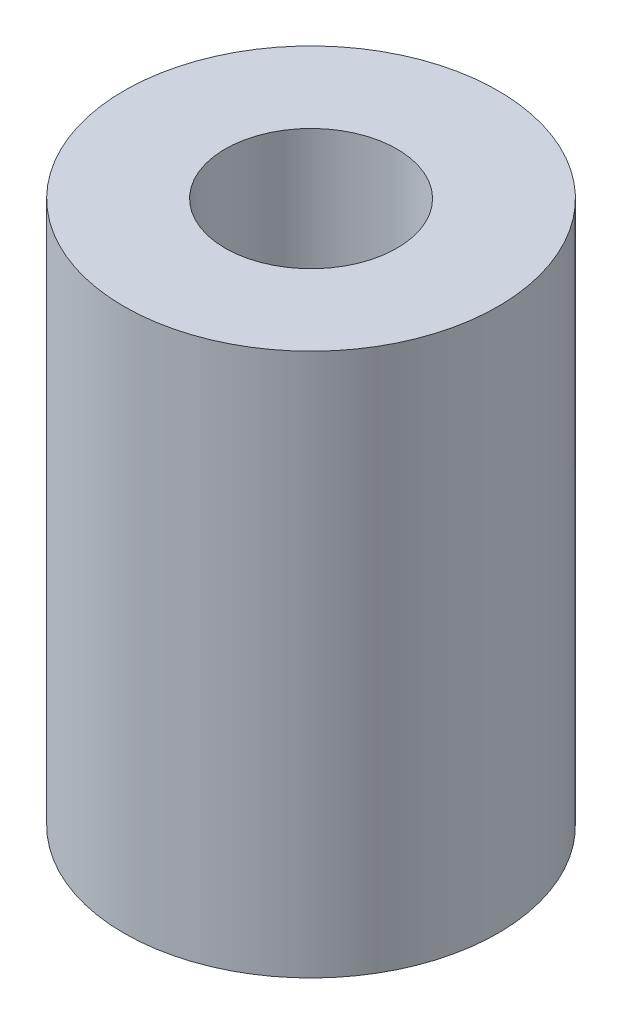
ISO-10303-21;
HEADER;
FILE_DESCRIPTION(('STEP AP214'),'2;1');
FILE_NAME('part.step','',(''),(''),'','','');
FILE_SCHEMA(('AUTOMOTIVE_DESIGN { 1 0 10303 214 1 1 1 1 }'));
ENDSEC;
DATA;
#1=APPLICATION_CONTEXT('core data for automotive mechanical design processes');
#2=APPLICATION_PROTOCOL_DEFINITION('international standard','automotive_design',2000,#1);
#3=PRODUCT_CONTEXT('',#1,'mechanical');
#4=PRODUCT('Part','Part','',(#3));
#5=PRODUCT_RELATED_PRODUCT_CATEGORY('part','',(#4));
#6=PRODUCT_DEFINITION_FORMATION('','',#4);
#7=PRODUCT_DEFINITION_CONTEXT('part definition',#1,'design');
#8=PRODUCT_DEFINITION('design','',#6,#7);
#9=PRODUCT_DEFINITION_SHAPE('','',#8);
#10=(LENGTH_UNIT() NAMED_UNIT(*) SI_UNIT(.MILLI.,.METRE.));
#11=(NAMED_UNIT(*) PLANE_ANGLE_UNIT() SI_UNIT($,.RADIAN.));
#12=(NAMED_UNIT(*) SI_UNIT($,.STERADIAN.) SOLID_ANGLE_UNIT());
#13=UNCERTAINTY_MEASURE_WITH_UNIT(LENGTH_MEASURE(1.E-05),#10,'distance_accuracy_value','');
#14=(GEOMETRIC_REPRESENTATION_CONTEXT(3) GLOBAL_UNCERTAINTY_ASSIGNED_CONTEXT((#13)) GLOBAL_UNIT_ASSIGNED_CONTEXT((#10,
#11,#12)) REPRESENTATION_CONTEXT('',''));
#15=CARTESIAN_POINT('',(0.,0.,0.));
#16=DIRECTION('',(0.,0.,1.));
#17=DIRECTION('',(1.,0.,0.));
#18=AXIS2_PLACEMENT_3D('',#15,#16,#17);
#19=CARTESIAN_POINT('',(0.,9.,0.));
#20=DIRECTION('',(0.,-1.,0.));
#21=DIRECTION('',(0.,0.,-1.));
#22=AXIS2_PLACEMENT_3D('',#19,#20,#21);
#23=CYLINDRICAL_SURFACE('',#22,3.1);
#24=CARTESIAN_POINT('',(0.,9.,0.));
#25=DIRECTION('',(0.,1.,0.));
#26=DIRECTION('',(0.,0.,1.));
#27=AXIS2_PLACEMENT_3D('',#24,#25,#26);
#28=CIRCLE('',#27,3.1);
#29=CARTESIAN_POINT('',(0.,9.,3.1));
#30=VERTEX_POINT('',#29);
#31=EDGE_CURVE('E10',#30,#30,#28,.T.);
#32=ORIENTED_EDGE('',*,*,#31,.F.);
#33=EDGE_LOOP('',(#32));
#34=FACE_BOUND('',#33,.T.);
#35=CARTESIAN_POINT('',(0.,0.,0.));
#36=DIRECTION('',(0.,1.,0.));
#37=DIRECTION('',(0.,0.,1.));
#38=AXIS2_PLACEMENT_3D('',#35,#36,#37);
#39=CIRCLE('',#38,3.1);
#40=CARTESIAN_POINT('',(0.,0.,3.1));
#41=VERTEX_POINT('',#40);
#42=EDGE_CURVE('E40',#41,#41,#39,.T.);
#43=ORIENTED_EDGE('',*,*,#42,.T.);
#44=EDGE_LOOP('',(#43));
#45=FACE_BOUND('',#44,.T.);
#46=ADVANCED_FACE('F37',(#34,#45),#23,.T.);
#47=CARTESIAN_POINT('',(0.,9.,0.));
#48=DIRECTION('',(0.,1.,0.));
#49=DIRECTION('',(0.,0.,1.));
#50=AXIS2_PLACEMENT_3D('',#47,#48,#49);
#51=PLANE('',#50);
#52=CARTESIAN_POINT('',(0.,9.,0.));
#53=DIRECTION('',(0.,1.,0.));
#54=DIRECTION('',(0.,0.,1.));
#55=AXIS2_PLACEMENT_3D('',#52,#53,#54);
#56=CIRCLE('',#55,1.425);
#57=CARTESIAN_POINT('',(0.,9.,1.425));
#58=VERTEX_POINT('',#57);
#59=EDGE_CURVE('E51',#58,#58,#56,.T.);
#60=ORIENTED_EDGE('',*,*,#59,.F.);
#61=EDGE_LOOP('',(#60));
#62=FACE_BOUND('',#61,.T.);
#63=ORIENTED_EDGE('',*,*,#31,.T.);
#64=EDGE_LOOP('',(#63));
#65=FACE_BOUND('',#64,.T.);
#66=ADVANCED_FACE('F68',(#62,#65),#51,.T.);
#67=CARTESIAN_POINT('',(0.,0.,0.));
#68=DIRECTION('',(0.,1.,0.));
#69=DIRECTION('',(0.,0.,1.));
#70=AXIS2_PLACEMENT_3D('',#67,#68,#69);
#71=PLANE('',#70);
#72=CARTESIAN_POINT('',(0.,0.,0.));
#73=DIRECTION('',(0.,1.,0.));
#74=DIRECTION('',(0.,0.,1.));
#75=AXIS2_PLACEMENT_3D('',#72,#73,#74);
#76=CIRCLE('',#75,1.425);
#77=CARTESIAN_POINT('',(0.,0.,1.425));
#78=VERTEX_POINT('',#77);
#79=EDGE_CURVE('E49',#78,#78,#76,.T.);
#80=ORIENTED_EDGE('',*,*,#79,.T.);
#81=EDGE_LOOP('',(#80));
#82=FACE_BOUND('',#81,.T.);
#83=ORIENTED_EDGE('',*,*,#42,.F.);
#84=EDGE_LOOP('',(#83));
#85=FACE_BOUND('',#84,.T.);
#86=ADVANCED_FACE('F59',(#82,#85),#71,.F.);
#87=CARTESIAN_POINT('',(0.,0.,0.));
#88=DIRECTION('',(0.,1.,0.));
#89=DIRECTION('',(0.,0.,1.));
#90=AXIS2_PLACEMENT_3D('',#87,#88,#89);
#91=CYLINDRICAL_SURFACE('',#90,1.425);
#92=ORIENTED_EDGE('',*,*,#79,.F.);
#93=EDGE_LOOP('',(#92));
#94=FACE_BOUND('',#93,.T.);
#95=ORIENTED_EDGE('',*,*,#59,.T.);
#96=EDGE_LOOP('',(#95));
#97=FACE_BOUND('',#96,.T.);
#98=ADVANCED_FACE('F62',(#94,#97),#91,.F.);
#99=CLOSED_SHELL('',(#46,#66,#86,#98));
#100=MANIFOLD_SOLID_BREP('B2',#99);
#101=ADVANCED_BREP_SHAPE_REPRESENTATION('',(#18,#100),#14);
#102=SHAPE_DEFINITION_REPRESENTATION(#9,#101);
ENDSEC;
END-ISO-10303-21;
